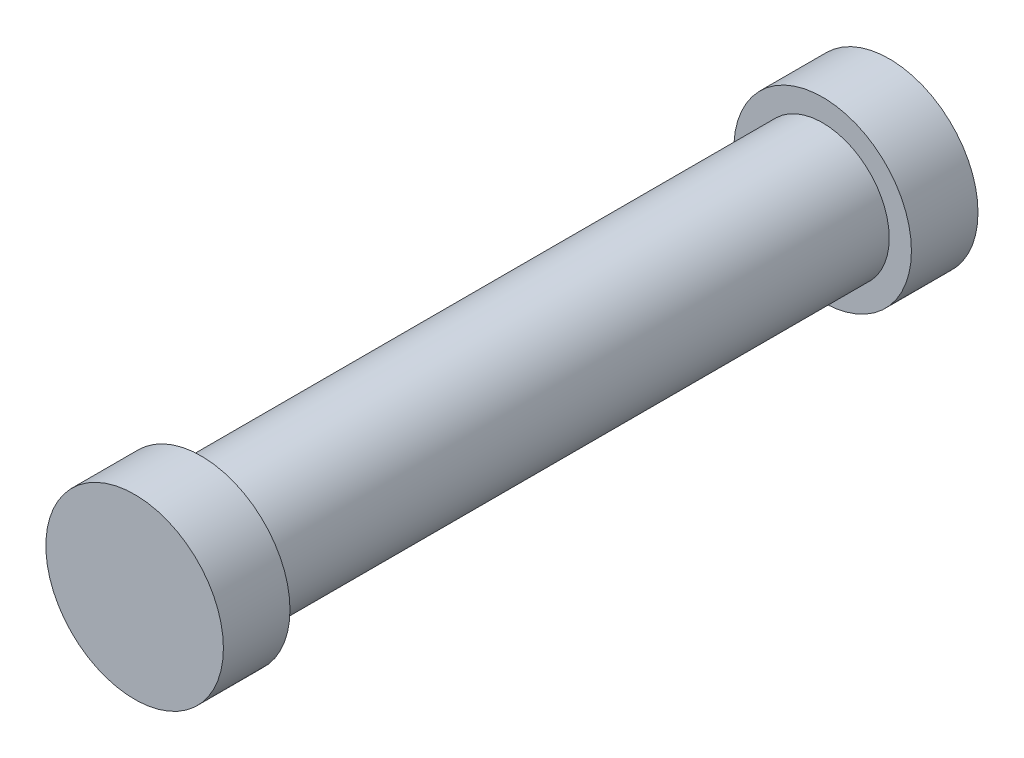
ISO-10303-21;
HEADER;
FILE_DESCRIPTION(('STEP AP214'),'2;1');
FILE_NAME('part.step','',(''),(''),'','','');
FILE_SCHEMA(('AUTOMOTIVE_DESIGN { 1 0 10303 214 1 1 1 1 }'));
ENDSEC;
DATA;
#1=APPLICATION_CONTEXT('core data for automotive mechanical design processes');
#2=APPLICATION_PROTOCOL_DEFINITION('international standard','automotive_design',2000,#1);
#3=PRODUCT_CONTEXT('',#1,'mechanical');
#4=PRODUCT('Part','Part','',(#3));
#5=PRODUCT_RELATED_PRODUCT_CATEGORY('part','',(#4));
#6=PRODUCT_DEFINITION_FORMATION('','',#4);
#7=PRODUCT_DEFINITION_CONTEXT('part definition',#1,'design');
#8=PRODUCT_DEFINITION('design','',#6,#7);
#9=PRODUCT_DEFINITION_SHAPE('','',#8);
#10=(LENGTH_UNIT() NAMED_UNIT(*) SI_UNIT(.MILLI.,.METRE.));
#11=(NAMED_UNIT(*) PLANE_ANGLE_UNIT() SI_UNIT($,.RADIAN.));
#12=(NAMED_UNIT(*) SI_UNIT($,.STERADIAN.) SOLID_ANGLE_UNIT());
#13=UNCERTAINTY_MEASURE_WITH_UNIT(LENGTH_MEASURE(1.E-05),#10,'distance_accuracy_value','');
#14=(GEOMETRIC_REPRESENTATION_CONTEXT(3) GLOBAL_UNCERTAINTY_ASSIGNED_CONTEXT((#13)) GLOBAL_UNIT_ASSIGNED_CONTEXT((#10,
#11,#12)) REPRESENTATION_CONTEXT('',''));
#15=CARTESIAN_POINT('',(0.,0.,0.));
#16=DIRECTION('',(0.,0.,1.));
#17=DIRECTION('',(1.,0.,0.));
#18=AXIS2_PLACEMENT_3D('',#15,#16,#17);
#19=CARTESIAN_POINT('',(0.,0.,19.05));
#20=DIRECTION('',(0.,0.,-1.));
#21=DIRECTION('',(-1.,0.,0.));
#22=AXIS2_PLACEMENT_3D('',#19,#20,#21);
#23=CYLINDRICAL_SURFACE('',#22,25.4);
#24=CARTESIAN_POINT('',(0.,0.,19.05));
#25=DIRECTION('',(0.,0.,1.));
#26=DIRECTION('',(1.,0.,0.));
#27=AXIS2_PLACEMENT_3D('',#24,#25,#26);
#28=CIRCLE('',#27,25.4);
#29=CARTESIAN_POINT('',(25.4,0.,19.05));
#30=VERTEX_POINT('',#29);
#31=EDGE_CURVE('E10',#30,#30,#28,.T.);
#32=ORIENTED_EDGE('',*,*,#31,.F.);
#33=EDGE_LOOP('',(#32));
#34=FACE_BOUND('',#33,.T.);
#35=CARTESIAN_POINT('',(0.,0.,0.));
#36=DIRECTION('',(0.,0.,1.));
#37=DIRECTION('',(1.,0.,0.));
#38=AXIS2_PLACEMENT_3D('',#35,#36,#37);
#39=CIRCLE('',#38,25.4);
#40=CARTESIAN_POINT('',(25.4,0.,0.));
#41=VERTEX_POINT('',#40);
#42=EDGE_CURVE('E33',#41,#41,#39,.T.);
#43=ORIENTED_EDGE('',*,*,#42,.T.);
#44=EDGE_LOOP('',(#43));
#45=FACE_BOUND('',#44,.T.);
#46=ADVANCED_FACE('F30',(#34,#45),#23,.T.);
#47=CARTESIAN_POINT('',(0.,0.,19.05));
#48=DIRECTION('',(0.,0.,1.));
#49=DIRECTION('',(1.,0.,0.));
#50=AXIS2_PLACEMENT_3D('',#47,#48,#49);
#51=PLANE('',#50);
#52=CARTESIAN_POINT('',(0.,0.,19.05));
#53=DIRECTION('',(0.,0.,1.));
#54=DIRECTION('',(1.,0.,0.));
#55=AXIS2_PLACEMENT_3D('',#52,#53,#54);
#56=CIRCLE('',#55,19.05);
#57=CARTESIAN_POINT('',(19.05,0.,19.05));
#58=VERTEX_POINT('',#57);
#59=EDGE_CURVE('E42',#58,#58,#56,.T.);
#60=ORIENTED_EDGE('',*,*,#59,.F.);
#61=EDGE_LOOP('',(#60));
#62=FACE_BOUND('',#61,.T.);
#63=ORIENTED_EDGE('',*,*,#31,.T.);
#64=EDGE_LOOP('',(#63));
#65=FACE_BOUND('',#64,.T.);
#66=ADVANCED_FACE('F72',(#62,#65),#51,.T.);
#67=CARTESIAN_POINT('',(0.,0.,0.));
#68=DIRECTION('',(0.,0.,1.));
#69=DIRECTION('',(1.,0.,0.));
#70=AXIS2_PLACEMENT_3D('',#67,#68,#69);
#71=PLANE('',#70);
#72=ORIENTED_EDGE('',*,*,#42,.F.);
#73=EDGE_LOOP('',(#72));
#74=FACE_BOUND('',#73,.T.);
#75=ADVANCED_FACE('F77',(#74),#71,.F.);
#76=CARTESIAN_POINT('',(0.,0.,196.85));
#77=DIRECTION('',(0.,0.,-1.));
#78=DIRECTION('',(-1.,0.,0.));
#79=AXIS2_PLACEMENT_3D('',#76,#77,#78);
#80=CYLINDRICAL_SURFACE('',#79,19.05);
#81=CARTESIAN_POINT('',(0.,0.,196.85));
#82=DIRECTION('',(0.,0.,1.));
#83=DIRECTION('',(1.,0.,0.));
#84=AXIS2_PLACEMENT_3D('',#81,#82,#83);
#85=CIRCLE('',#84,19.05);
#86=CARTESIAN_POINT('',(19.05,0.,196.85));
#87=VERTEX_POINT('',#86);
#88=EDGE_CURVE('E40',#87,#87,#85,.T.);
#89=ORIENTED_EDGE('',*,*,#88,.F.);
#90=EDGE_LOOP('',(#89));
#91=FACE_BOUND('',#90,.T.);
#92=ORIENTED_EDGE('',*,*,#59,.T.);
#93=EDGE_LOOP('',(#92));
#94=FACE_BOUND('',#93,.T.);
#95=ADVANCED_FACE('F59',(#91,#94),#80,.T.);
#96=CARTESIAN_POINT('',(0.,0.,215.9));
#97=DIRECTION('',(0.,0.,-1.));
#98=DIRECTION('',(-1.,0.,0.));
#99=AXIS2_PLACEMENT_3D('',#96,#97,#98);
#100=CYLINDRICAL_SURFACE('',#99,25.4);
#101=CARTESIAN_POINT('',(0.,0.,215.9));
#102=DIRECTION('',(0.,0.,1.));
#103=DIRECTION('',(1.,0.,0.));
#104=AXIS2_PLACEMENT_3D('',#101,#102,#103);
#105=CIRCLE('',#104,25.4);
#106=CARTESIAN_POINT('',(25.4,0.,215.9));
#107=VERTEX_POINT('',#106);
#108=EDGE_CURVE('E45',#107,#107,#105,.T.);
#109=ORIENTED_EDGE('',*,*,#108,.F.);
#110=EDGE_LOOP('',(#109));
#111=FACE_BOUND('',#110,.T.);
#112=CARTESIAN_POINT('',(0.,0.,196.85));
#113=DIRECTION('',(0.,0.,1.));
#114=DIRECTION('',(1.,0.,0.));
#115=AXIS2_PLACEMENT_3D('',#112,#113,#114);
#116=CIRCLE('',#115,25.4);
#117=CARTESIAN_POINT('',(25.4,0.,196.85));
#118=VERTEX_POINT('',#117);
#119=EDGE_CURVE('E48',#118,#118,#116,.T.);
#120=ORIENTED_EDGE('',*,*,#119,.T.);
#121=EDGE_LOOP('',(#120));
#122=FACE_BOUND('',#121,.T.);
#123=ADVANCED_FACE('F56',(#111,#122),#100,.T.);
#124=CARTESIAN_POINT('',(0.,0.,215.9));
#125=DIRECTION('',(0.,0.,1.));
#126=DIRECTION('',(1.,0.,0.));
#127=AXIS2_PLACEMENT_3D('',#124,#125,#126);
#128=PLANE('',#127);
#129=ORIENTED_EDGE('',*,*,#108,.T.);
#130=EDGE_LOOP('',(#129));
#131=FACE_BOUND('',#130,.T.);
#132=ADVANCED_FACE('F54',(#131),#128,.T.);
#133=CARTESIAN_POINT('',(0.,0.,196.85));
#134=DIRECTION('',(0.,0.,1.));
#135=DIRECTION('',(1.,0.,0.));
#136=AXIS2_PLACEMENT_3D('',#133,#134,#135);
#137=PLANE('',#136);
#138=ORIENTED_EDGE('',*,*,#88,.T.);
#139=EDGE_LOOP('',(#138));
#140=FACE_BOUND('',#139,.T.);
#141=ORIENTED_EDGE('',*,*,#119,.F.);
#142=EDGE_LOOP('',(#141));
#143=FACE_BOUND('',#142,.T.);
#144=ADVANCED_FACE('F63',(#140,#143),#137,.F.);
#145=CLOSED_SHELL('',(#46,#66,#75,#95,#123,#132,#144));
#146=MANIFOLD_SOLID_BREP('B2',#145);
#147=ADVANCED_BREP_SHAPE_REPRESENTATION('',(#18,#146),#14);
#148=SHAPE_DEFINITION_REPRESENTATION(#9,#147);
ENDSEC;
END-ISO-10303-21;
